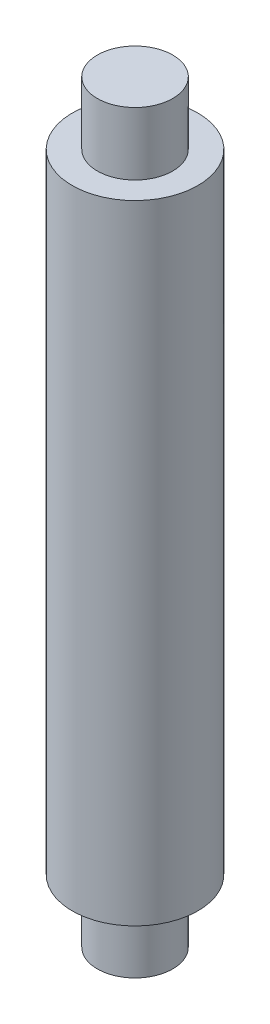
ISO-10303-21;
HEADER;
FILE_DESCRIPTION(('STEP AP214'),'2;1');
FILE_NAME('part.step','',(''),(''),'','','');
FILE_SCHEMA(('AUTOMOTIVE_DESIGN { 1 0 10303 214 1 1 1 1 }'));
ENDSEC;
DATA;
#1=APPLICATION_CONTEXT('core data for automotive mechanical design processes');
#2=APPLICATION_PROTOCOL_DEFINITION('international standard','automotive_design',2000,#1);
#3=PRODUCT_CONTEXT('',#1,'mechanical');
#4=PRODUCT('Part','Part','',(#3));
#5=PRODUCT_RELATED_PRODUCT_CATEGORY('part','',(#4));
#6=PRODUCT_DEFINITION_FORMATION('','',#4);
#7=PRODUCT_DEFINITION_CONTEXT('part definition',#1,'design');
#8=PRODUCT_DEFINITION('design','',#6,#7);
#9=PRODUCT_DEFINITION_SHAPE('','',#8);
#10=(LENGTH_UNIT() NAMED_UNIT(*) SI_UNIT(.MILLI.,.METRE.));
#11=(NAMED_UNIT(*) PLANE_ANGLE_UNIT() SI_UNIT($,.RADIAN.));
#12=(NAMED_UNIT(*) SI_UNIT($,.STERADIAN.) SOLID_ANGLE_UNIT());
#13=UNCERTAINTY_MEASURE_WITH_UNIT(LENGTH_MEASURE(1.E-05),#10,'distance_accuracy_value','');
#14=(GEOMETRIC_REPRESENTATION_CONTEXT(3) GLOBAL_UNCERTAINTY_ASSIGNED_CONTEXT((#13)) GLOBAL_UNIT_ASSIGNED_CONTEXT((#10,
#11,#12)) REPRESENTATION_CONTEXT('',''));
#15=CARTESIAN_POINT('',(0.,0.,0.));
#16=DIRECTION('',(0.,0.,1.));
#17=DIRECTION('',(1.,0.,0.));
#18=AXIS2_PLACEMENT_3D('',#15,#16,#17);
#19=CARTESIAN_POINT('',(0.,60.,0.));
#20=DIRECTION('',(0.,-1.,0.));
#21=DIRECTION('',(0.,0.,-1.));
#22=AXIS2_PLACEMENT_3D('',#19,#20,#21);
#23=PLANE('',#22);
#24=CARTESIAN_POINT('',(0.,60.,0.));
#25=DIRECTION('',(0.,-1.,0.));
#26=DIRECTION('',(0.,0.,-1.));
#27=AXIS2_PLACEMENT_3D('',#24,#25,#26);
#28=CIRCLE('',#27,6.00000000000002);
#29=CARTESIAN_POINT('',(0.,60.,-6.00000000000002));
#30=VERTEX_POINT('',#29);
#31=EDGE_CURVE('E10',#30,#30,#28,.T.);
#32=ORIENTED_EDGE('',*,*,#31,.F.);
#33=EDGE_LOOP('',(#32));
#34=FACE_BOUND('',#33,.T.);
#35=ADVANCED_FACE('F32',(#34),#23,.F.);
#36=CARTESIAN_POINT('',(0.,0.,0.));
#37=DIRECTION('',(0.,-1.,0.));
#38=DIRECTION('',(0.,0.,-1.));
#39=AXIS2_PLACEMENT_3D('',#36,#37,#38);
#40=CYLINDRICAL_SURFACE('',#39,6.00000000000001);
#41=CARTESIAN_POINT('',(0.,50.,0.));
#42=DIRECTION('',(0.,-1.,0.));
#43=DIRECTION('',(0.,0.,-1.));
#44=AXIS2_PLACEMENT_3D('',#41,#42,#43);
#45=CIRCLE('',#44,6.00000000000001);
#46=CARTESIAN_POINT('',(0.,50.,-6.00000000000001));
#47=VERTEX_POINT('',#46);
#48=EDGE_CURVE('E38',#47,#47,#45,.T.);
#49=ORIENTED_EDGE('',*,*,#48,.F.);
#50=EDGE_LOOP('',(#49));
#51=FACE_BOUND('',#50,.T.);
#52=ORIENTED_EDGE('',*,*,#31,.T.);
#53=EDGE_LOOP('',(#52));
#54=FACE_BOUND('',#53,.T.);
#55=ADVANCED_FACE('F80',(#51,#54),#40,.T.);
#56=CARTESIAN_POINT('',(-6.00000000000001,50.,0.));
#57=DIRECTION('',(0.,-1.,0.));
#58=DIRECTION('',(0.,0.,-1.));
#59=AXIS2_PLACEMENT_3D('',#56,#57,#58);
#60=PLANE('',#59);
#61=CARTESIAN_POINT('',(0.,50.,0.));
#62=DIRECTION('',(0.,-1.,0.));
#63=DIRECTION('',(0.,0.,-1.));
#64=AXIS2_PLACEMENT_3D('',#61,#62,#63);
#65=CIRCLE('',#64,10.);
#66=CARTESIAN_POINT('',(0.,50.,-10.));
#67=VERTEX_POINT('',#66);
#68=EDGE_CURVE('E42',#67,#67,#65,.T.);
#69=ORIENTED_EDGE('',*,*,#68,.F.);
#70=EDGE_LOOP('',(#69));
#71=FACE_BOUND('',#70,.T.);
#72=ORIENTED_EDGE('',*,*,#48,.T.);
#73=EDGE_LOOP('',(#72));
#74=FACE_BOUND('',#73,.T.);
#75=ADVANCED_FACE('F75',(#71,#74),#60,.F.);
#76=CARTESIAN_POINT('',(0.,0.,0.));
#77=DIRECTION('',(0.,-1.,0.));
#78=DIRECTION('',(0.,0.,-1.));
#79=AXIS2_PLACEMENT_3D('',#76,#77,#78);
#80=CYLINDRICAL_SURFACE('',#79,10.);
#81=CARTESIAN_POINT('',(0.,-50.,0.));
#82=DIRECTION('',(0.,-1.,0.));
#83=DIRECTION('',(0.,0.,-1.));
#84=AXIS2_PLACEMENT_3D('',#81,#82,#83);
#85=CIRCLE('',#84,9.99999999999999);
#86=CARTESIAN_POINT('',(0.,-50.,-9.99999999999999));
#87=VERTEX_POINT('',#86);
#88=EDGE_CURVE('E46',#87,#87,#85,.T.);
#89=ORIENTED_EDGE('',*,*,#88,.F.);
#90=EDGE_LOOP('',(#89));
#91=FACE_BOUND('',#90,.T.);
#92=ORIENTED_EDGE('',*,*,#68,.T.);
#93=EDGE_LOOP('',(#92));
#94=FACE_BOUND('',#93,.T.);
#95=ADVANCED_FACE('F69',(#91,#94),#80,.T.);
#96=CARTESIAN_POINT('',(-9.99999999999999,-50.,0.));
#97=DIRECTION('',(0.,1.,0.));
#98=DIRECTION('',(0.,0.,1.));
#99=AXIS2_PLACEMENT_3D('',#96,#97,#98);
#100=PLANE('',#99);
#101=CARTESIAN_POINT('',(0.,-50.,0.));
#102=DIRECTION('',(0.,-1.,0.));
#103=DIRECTION('',(0.,0.,-1.));
#104=AXIS2_PLACEMENT_3D('',#101,#102,#103);
#105=CIRCLE('',#104,6.);
#106=CARTESIAN_POINT('',(0.,-50.,-6.));
#107=VERTEX_POINT('',#106);
#108=EDGE_CURVE('E51',#107,#107,#105,.T.);
#109=ORIENTED_EDGE('',*,*,#108,.F.);
#110=EDGE_LOOP('',(#109));
#111=FACE_BOUND('',#110,.T.);
#112=ORIENTED_EDGE('',*,*,#88,.T.);
#113=EDGE_LOOP('',(#112));
#114=FACE_BOUND('',#113,.T.);
#115=ADVANCED_FACE('F63',(#111,#114),#100,.F.);
#116=CARTESIAN_POINT('',(0.,0.,0.));
#117=DIRECTION('',(0.,-1.,0.));
#118=DIRECTION('',(0.,0.,-1.));
#119=AXIS2_PLACEMENT_3D('',#116,#117,#118);
#120=CYLINDRICAL_SURFACE('',#119,6.);
#121=CARTESIAN_POINT('',(0.,-60.,0.));
#122=DIRECTION('',(0.,-1.,0.));
#123=DIRECTION('',(0.,0.,-1.));
#124=AXIS2_PLACEMENT_3D('',#121,#122,#123);
#125=CIRCLE('',#124,6.);
#126=CARTESIAN_POINT('',(0.,-60.,-6.));
#127=VERTEX_POINT('',#126);
#128=EDGE_CURVE('E54',#127,#127,#125,.T.);
#129=ORIENTED_EDGE('',*,*,#128,.F.);
#130=EDGE_LOOP('',(#129));
#131=FACE_BOUND('',#130,.T.);
#132=ORIENTED_EDGE('',*,*,#108,.T.);
#133=EDGE_LOOP('',(#132));
#134=FACE_BOUND('',#133,.T.);
#135=ADVANCED_FACE('F60',(#131,#134),#120,.T.);
#136=CARTESIAN_POINT('',(-6.,-60.,0.));
#137=DIRECTION('',(0.,1.,0.));
#138=DIRECTION('',(0.,0.,1.));
#139=AXIS2_PLACEMENT_3D('',#136,#137,#138);
#140=PLANE('',#139);
#141=ORIENTED_EDGE('',*,*,#128,.T.);
#142=EDGE_LOOP('',(#141));
#143=FACE_BOUND('',#142,.T.);
#144=ADVANCED_FACE('F58',(#143),#140,.F.);
#145=CLOSED_SHELL('',(#35,#55,#75,#95,#115,#135,#144));
#146=MANIFOLD_SOLID_BREP('B2',#145);
#147=ADVANCED_BREP_SHAPE_REPRESENTATION('',(#18,#146),#14);
#148=SHAPE_DEFINITION_REPRESENTATION(#9,#147);
ENDSEC;
END-ISO-10303-21;
